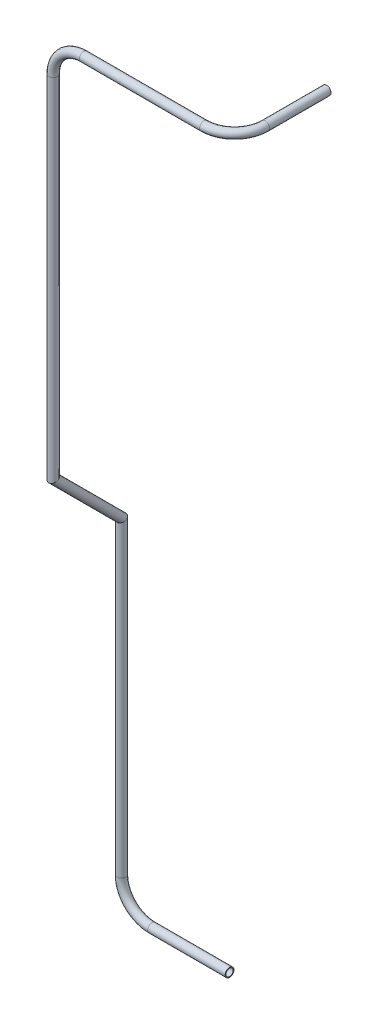
ISO-10303-21;
HEADER;
FILE_DESCRIPTION(('STEP AP214'),'2;1');
FILE_NAME('part.step','',(''),(''),'','','');
FILE_SCHEMA(('AUTOMOTIVE_DESIGN { 1 0 10303 214 1 1 1 1 }'));
ENDSEC;
DATA;
#1=APPLICATION_CONTEXT('core data for automotive mechanical design processes');
#2=APPLICATION_PROTOCOL_DEFINITION('international standard','automotive_design',2000,#1);
#3=PRODUCT_CONTEXT('',#1,'mechanical');
#4=PRODUCT('Part','Part','',(#3));
#5=PRODUCT_RELATED_PRODUCT_CATEGORY('part','',(#4));
#6=PRODUCT_DEFINITION_FORMATION('','',#4);
#7=PRODUCT_DEFINITION_CONTEXT('part definition',#1,'design');
#8=PRODUCT_DEFINITION('design','',#6,#7);
#9=PRODUCT_DEFINITION_SHAPE('','',#8);
#10=(LENGTH_UNIT() NAMED_UNIT(*) SI_UNIT(.MILLI.,.METRE.));
#11=(NAMED_UNIT(*) PLANE_ANGLE_UNIT() SI_UNIT($,.RADIAN.));
#12=(NAMED_UNIT(*) SI_UNIT($,.STERADIAN.) SOLID_ANGLE_UNIT());
#13=UNCERTAINTY_MEASURE_WITH_UNIT(LENGTH_MEASURE(1.E-05),#10,'distance_accuracy_value','');
#14=(GEOMETRIC_REPRESENTATION_CONTEXT(3) GLOBAL_UNCERTAINTY_ASSIGNED_CONTEXT((#13)) GLOBAL_UNIT_ASSIGNED_CONTEXT((#10,
#11,#12)) REPRESENTATION_CONTEXT('',''));
#15=CARTESIAN_POINT('',(0.,0.,0.));
#16=DIRECTION('',(0.,0.,1.));
#17=DIRECTION('',(1.,0.,0.));
#18=AXIS2_PLACEMENT_3D('',#15,#16,#17);
#19=CARTESIAN_POINT('',(-1077.05064960257,1343.43316900332,524.509271735352));
#20=DIRECTION('',(1.,0.,0.));
#21=DIRECTION('',(0.,0.,-1.));
#22=AXIS2_PLACEMENT_3D('',#19,#20,#21);
#23=CYLINDRICAL_SURFACE('',#22,2.61620000000002);
#24=CARTESIAN_POINT('',(-1020.80832925557,1343.43316900332,524.509271735351));
#25=DIRECTION('',(-1.,0.,0.));
#26=DIRECTION('',(0.,0.,1.));
#27=AXIS2_PLACEMENT_3D('',#24,#25,#26);
#28=CIRCLE('',#27,2.61620000000002);
#29=CARTESIAN_POINT('',(-1020.80832925557,1343.43316900332,527.125471735352));
#30=VERTEX_POINT('',#29);
#31=EDGE_CURVE('E54',#30,#30,#28,.T.);
#32=ORIENTED_EDGE('',*,*,#31,.F.);
#33=EDGE_LOOP('',(#32));
#34=FACE_BOUND('',#33,.T.);
#35=CARTESIAN_POINT('',(-1077.05064960257,1343.43316900332,524.509271735352));
#36=DIRECTION('',(1.,0.,0.));
#37=DIRECTION('',(0.,0.,-1.));
#38=AXIS2_PLACEMENT_3D('',#35,#36,#37);
#39=CIRCLE('',#38,2.61620000000002);
#40=CARTESIAN_POINT('',(-1077.05064960257,1340.81696900332,524.509271735352));
#41=VERTEX_POINT('',#40);
#42=EDGE_CURVE('E65',#41,#41,#39,.T.);
#43=ORIENTED_EDGE('',*,*,#42,.F.);
#44=EDGE_LOOP('',(#43));
#45=FACE_BOUND('',#44,.T.);
#46=ADVANCED_FACE('F47',(#34,#45),#23,.F.);
#47=CARTESIAN_POINT('',(-1077.05064960257,1343.43316900332,524.509271735352));
#48=DIRECTION('',(1.,0.,0.));
#49=DIRECTION('',(0.,0.,-1.));
#50=AXIS2_PLACEMENT_3D('',#47,#48,#49);
#51=CYLINDRICAL_SURFACE('',#50,3.175);
#52=CARTESIAN_POINT('',(-1020.80832925557,1343.43316900332,524.509271735351));
#53=DIRECTION('',(-1.,0.,0.));
#54=DIRECTION('',(0.,0.,1.));
#55=AXIS2_PLACEMENT_3D('',#52,#53,#54);
#56=CIRCLE('',#55,3.175);
#57=CARTESIAN_POINT('',(-1020.80832925557,1343.43316900332,527.684271735351));
#58=VERTEX_POINT('',#57);
#59=EDGE_CURVE('E58',#58,#58,#56,.T.);
#60=ORIENTED_EDGE('',*,*,#59,.T.);
#61=EDGE_LOOP('',(#60));
#62=FACE_BOUND('',#61,.T.);
#63=CARTESIAN_POINT('',(-1077.05064960257,1343.43316900332,524.509271735352));
#64=DIRECTION('',(-1.,0.,0.));
#65=DIRECTION('',(0.,0.,1.));
#66=AXIS2_PLACEMENT_3D('',#63,#64,#65);
#67=CIRCLE('',#66,3.175);
#68=CARTESIAN_POINT('',(-1077.05064960257,1340.25816900332,524.509271735352));
#69=VERTEX_POINT('',#68);
#70=EDGE_CURVE('E12',#69,#69,#67,.T.);
#71=ORIENTED_EDGE('',*,*,#70,.F.);
#72=EDGE_LOOP('',(#71));
#73=FACE_BOUND('',#72,.T.);
#74=ADVANCED_FACE('F49',(#62,#73),#51,.T.);
#75=CARTESIAN_POINT('',(-1020.80832925557,1343.43316900332,524.509271735351));
#76=DIRECTION('',(-1.,0.,0.));
#77=DIRECTION('',(0.,0.,1.));
#78=AXIS2_PLACEMENT_3D('',#75,#76,#77);
#79=PLANE('',#78);
#80=ORIENTED_EDGE('',*,*,#31,.T.);
#81=EDGE_LOOP('',(#80));
#82=FACE_BOUND('',#81,.T.);
#83=ORIENTED_EDGE('',*,*,#59,.F.);
#84=EDGE_LOOP('',(#83));
#85=FACE_BOUND('',#84,.T.);
#86=ADVANCED_FACE('F104',(#82,#85),#79,.F.);
#87=CARTESIAN_POINT('',(-1077.05064960257,1365.65816900332,524.509271735352));
#88=DIRECTION('',(0.,0.,1.));
#89=DIRECTION('',(1.,0.,0.));
#90=AXIS2_PLACEMENT_3D('',#87,#88,#89);
#91=TOROIDAL_SURFACE('',#90,22.2249999999997,2.61620000000002);
#92=CARTESIAN_POINT('',(-1099.27564960257,1365.65816900332,524.509271735351));
#93=DIRECTION('',(0.,-1.,0.));
#94=DIRECTION('',(0.,0.,-1.));
#95=AXIS2_PLACEMENT_3D('',#92,#93,#94);
#96=CIRCLE('',#95,2.61620000000002);
#97=CARTESIAN_POINT('',(-1101.89184960257,1365.65816900332,524.509271735351));
#98=VERTEX_POINT('',#97);
#99=EDGE_CURVE('E71',#98,#98,#96,.T.);
#100=CARTESIAN_POINT('',(-1077.05064960257,1365.65816900332,524.509271735352));
#101=DIRECTION('',(0.,0.,1.));
#102=DIRECTION('',(1.,0.,0.));
#103=AXIS2_PLACEMENT_3D('',#100,#101,#102);
#104=CIRCLE('',#103,24.8411999999997);
#105=EDGE_CURVE('',#98,#41,#104,.T.);
#106=ORIENTED_EDGE('',*,*,#99,.F.);
#107=ORIENTED_EDGE('',*,*,#42,.T.);
#108=ORIENTED_EDGE('',*,*,#105,.T.);
#109=ORIENTED_EDGE('',*,*,#105,.F.);
#110=EDGE_LOOP('',(#106,#108,#107,#109));
#111=FACE_BOUND('',#110,.T.);
#112=ADVANCED_FACE('F97',(#111),#91,.F.);
#113=CARTESIAN_POINT('',(-1077.05064960257,1365.65816900332,524.509271735352));
#114=DIRECTION('',(0.,0.,1.));
#115=DIRECTION('',(1.,0.,0.));
#116=AXIS2_PLACEMENT_3D('',#113,#114,#115);
#117=TOROIDAL_SURFACE('',#116,22.2249999999997,3.175);
#118=CARTESIAN_POINT('',(-1099.27564960257,1365.65816900332,524.509271735352));
#119=DIRECTION('',(0.,1.,0.));
#120=DIRECTION('',(0.,0.,1.));
#121=AXIS2_PLACEMENT_3D('',#118,#119,#120);
#122=CIRCLE('',#121,3.175);
#123=CARTESIAN_POINT('',(-1102.45064960257,1365.65816900332,524.509271735352));
#124=VERTEX_POINT('',#123);
#125=EDGE_CURVE('E62',#124,#124,#122,.T.);
#126=CARTESIAN_POINT('',(-1077.05064960257,1365.65816900332,524.509271735352));
#127=DIRECTION('',(0.,0.,1.));
#128=DIRECTION('',(1.,0.,0.));
#129=AXIS2_PLACEMENT_3D('',#126,#127,#128);
#130=CIRCLE('',#129,25.3999999999997);
#131=EDGE_CURVE('',#124,#69,#130,.T.);
#132=ORIENTED_EDGE('',*,*,#125,.F.);
#133=ORIENTED_EDGE('',*,*,#70,.T.);
#134=ORIENTED_EDGE('',*,*,#131,.T.);
#135=ORIENTED_EDGE('',*,*,#131,.F.);
#136=EDGE_LOOP('',(#132,#134,#133,#135));
#137=FACE_BOUND('',#136,.T.);
#138=ADVANCED_FACE('F95',(#137),#117,.T.);
#139=CARTESIAN_POINT('',(-1099.27564960257,1589.9901269649,524.509271735351));
#140=DIRECTION('',(0.,-1.,0.));
#141=DIRECTION('',(0.,0.,-1.));
#142=AXIS2_PLACEMENT_3D('',#139,#140,#141);
#143=CYLINDRICAL_SURFACE('',#142,2.61620000000002);
#144=CARTESIAN_POINT('',(-1099.27564960257,1589.9901269649,524.509271735351));
#145=DIRECTION('',(-0.0038512328374185,0.92387953251129,0.382664052939849));
#146=DIRECTION('',(-0.0092976985479526,-0.382683432365081,0.923832746440064));
#147=AXIS2_PLACEMENT_3D('',#144,#145,#146);
#148=ELLIPSE('',#147,2.83175447440497,2.61620000000002);
#149=CARTESIAN_POINT('',(-1099.30197840203,1588.90646144302,527.125339248685));
#150=VERTEX_POINT('',#149);
#151=EDGE_CURVE('E74',#150,#150,#148,.T.);
#152=ORIENTED_EDGE('',*,*,#151,.T.);
#153=EDGE_LOOP('',(#152));
#154=FACE_BOUND('',#153,.T.);
#155=ORIENTED_EDGE('',*,*,#99,.T.);
#156=EDGE_LOOP('',(#155));
#157=FACE_BOUND('',#156,.T.);
#158=ADVANCED_FACE('F80',(#154,#157),#143,.F.);
#159=CARTESIAN_POINT('',(-1099.27564960257,1589.9901269649,524.509271735351));
#160=DIRECTION('',(0.,-1.,0.));
#161=DIRECTION('',(0.,0.,-1.));
#162=AXIS2_PLACEMENT_3D('',#159,#160,#161);
#163=CYLINDRICAL_SURFACE('',#162,3.175);
#164=CARTESIAN_POINT('',(-1099.27564960257,1589.9901269649,524.509271735351));
#165=DIRECTION('',(-0.0038512328374185,0.92387953251129,0.382664052939849));
#166=DIRECTION('',(-0.0092976985479526,-0.382683432365081,0.923832746440064));
#167=AXIS2_PLACEMENT_3D('',#164,#165,#166);
#168=ELLIPSE('',#167,3.43659523592834,3.175);
#169=CARTESIAN_POINT('',(-1099.3076020291,1588.67499890437,527.684110950562));
#170=VERTEX_POINT('',#169);
#171=EDGE_CURVE('E68',#170,#170,#168,.T.);
#172=ORIENTED_EDGE('',*,*,#171,.F.);
#173=EDGE_LOOP('',(#172));
#174=FACE_BOUND('',#173,.T.);
#175=ORIENTED_EDGE('',*,*,#125,.T.);
#176=EDGE_LOOP('',(#175));
#177=FACE_BOUND('',#176,.T.);
#178=ADVANCED_FACE('F86',(#174,#177),#163,.T.);
#179=CARTESIAN_POINT('',(-1099.27564960257,1589.9901269649,524.509271735351));
#180=DIRECTION('',(-0.0038512328374185,0.92387953251129,0.382664052939849));
#181=DIRECTION('',(0.,-0.382666890806957,0.923886384075518));
#182=AXIS2_PLACEMENT_3D('',#179,#180,#181);
#183=PLANE('',#182);
#184=ORIENTED_EDGE('',*,*,#151,.F.);
#185=EDGE_LOOP('',(#184));
#186=FACE_BOUND('',#185,.T.);
#187=ORIENTED_EDGE('',*,*,#171,.T.);
#188=EDGE_LOOP('',(#187));
#189=FACE_BOUND('',#188,.T.);
#190=ADVANCED_FACE('F83',(#186,#189),#183,.T.);
#191=CLOSED_SHELL('',(#46,#74,#86,#112,#138,#158,#178,#190));
#192=MANIFOLD_SOLID_BREP('B2',#191);
#193=CARTESIAN_POINT('',(-1099.76967828225,1639.08001553007,573.596674345437));
#194=DIRECTION('',(0.00711615038685249,-0.707106781186548,-0.7070709726779));
#195=DIRECTION('',(0.,0.707088876252191,-0.707124685667537));
#196=AXIS2_PLACEMENT_3D('',#193,#194,#195);
#197=CYLINDRICAL_SURFACE('',#196,2.61620000000002);
#198=CARTESIAN_POINT('',(-1099.76967828225,1639.08001553007,573.596674345437));
#199=DIRECTION('',(-0.00385123283741945,0.92387953251129,0.382664052939849));
#200=DIRECTION('',(0.00929769854794952,0.382683432365082,-0.923832746440064));
#201=AXIS2_PLACEMENT_3D('',#198,#199,#200);
#202=ELLIPSE('',#201,2.83175447440499,2.61620000000002);
#203=CARTESIAN_POINT('',(-1099.74334948278,1640.16368105195,570.980606832104));
#204=VERTEX_POINT('',#203);
#205=EDGE_CURVE('E222',#204,#204,#202,.T.);
#206=ORIENTED_EDGE('',*,*,#205,.T.);
#207=EDGE_LOOP('',(#206));
#208=FACE_BOUND('',#207,.T.);
#209=CARTESIAN_POINT('',(-1099.27564960257,1589.9901269649,524.509271735352));
#210=DIRECTION('',(0.0038512328374185,-0.92387953251129,-0.382664052939849));
#211=DIRECTION('',(0.00929769854795181,0.382683432365081,-0.923832746440064));
#212=AXIS2_PLACEMENT_3D('',#209,#210,#211);
#213=ELLIPSE('',#212,2.83175447440499,2.61620000000002);
#214=CARTESIAN_POINT('',(-1099.2493208031,1591.07379248678,521.893204222018));
#215=VERTEX_POINT('',#214);
#216=EDGE_CURVE('E212',#215,#215,#213,.T.);
#217=ORIENTED_EDGE('',*,*,#216,.T.);
#218=EDGE_LOOP('',(#217));
#219=FACE_BOUND('',#218,.T.);
#220=ADVANCED_FACE('F208',(#208,#219),#197,.F.);
#221=CARTESIAN_POINT('',(-1099.76967828225,1639.08001553007,573.596674345437));
#222=DIRECTION('',(0.00711615038685249,-0.707106781186548,-0.7070709726779));
#223=DIRECTION('',(0.,0.707088876252191,-0.707124685667537));
#224=AXIS2_PLACEMENT_3D('',#221,#222,#223);
#225=CYLINDRICAL_SURFACE('',#224,3.175);
#226=CARTESIAN_POINT('',(-1099.76967828225,1639.08001553007,573.596674345437));
#227=DIRECTION('',(-0.00385123283741945,0.92387953251129,0.382664052939849));
#228=DIRECTION('',(0.00929769854794952,0.382683432365082,-0.923832746440064));
#229=AXIS2_PLACEMENT_3D('',#226,#227,#228);
#230=ELLIPSE('',#229,3.43659523592837,3.175);
#231=CARTESIAN_POINT('',(-1099.73772585571,1640.39514359061,570.421835130227));
#232=VERTEX_POINT('',#231);
#233=EDGE_CURVE('E216',#232,#232,#230,.T.);
#234=ORIENTED_EDGE('',*,*,#233,.F.);
#235=EDGE_LOOP('',(#234));
#236=FACE_BOUND('',#235,.T.);
#237=CARTESIAN_POINT('',(-1099.27564960257,1589.9901269649,524.509271735352));
#238=DIRECTION('',(0.0038512328374185,-0.92387953251129,-0.382664052939849));
#239=DIRECTION('',(0.00929769854795181,0.382683432365081,-0.923832746440064));
#240=AXIS2_PLACEMENT_3D('',#237,#238,#239);
#241=ELLIPSE('',#240,3.43659523592837,3.175);
#242=CARTESIAN_POINT('',(-1099.24369717603,1591.30525502543,521.334432520141));
#243=VERTEX_POINT('',#242);
#244=EDGE_CURVE('E46',#243,#243,#241,.T.);
#245=ORIENTED_EDGE('',*,*,#244,.F.);
#246=EDGE_LOOP('',(#245));
#247=FACE_BOUND('',#246,.T.);
#248=ADVANCED_FACE('F235',(#236,#247),#225,.T.);
#249=CARTESIAN_POINT('',(-1099.76967828225,1639.08001553007,573.596674345437));
#250=DIRECTION('',(-0.00385123283741945,0.92387953251129,0.382664052939849));
#251=DIRECTION('',(0.,-0.382666890806957,0.923886384075518));
#252=AXIS2_PLACEMENT_3D('',#249,#250,#251);
#253=PLANE('',#252);
#254=ORIENTED_EDGE('',*,*,#205,.F.);
#255=EDGE_LOOP('',(#254));
#256=FACE_BOUND('',#255,.T.);
#257=ORIENTED_EDGE('',*,*,#233,.T.);
#258=EDGE_LOOP('',(#257));
#259=FACE_BOUND('',#258,.T.);
#260=ADVANCED_FACE('F231',(#256,#259),#253,.T.);
#261=CARTESIAN_POINT('',(-1099.27564960257,1589.9901269649,524.509271735351));
#262=DIRECTION('',(0.0038512328374185,-0.92387953251129,-0.382664052939849));
#263=DIRECTION('',(0.,0.382666890806957,-0.923886384075518));
#264=AXIS2_PLACEMENT_3D('',#261,#262,#263);
#265=PLANE('',#264);
#266=ORIENTED_EDGE('',*,*,#216,.F.);
#267=EDGE_LOOP('',(#266));
#268=FACE_BOUND('',#267,.T.);
#269=ORIENTED_EDGE('',*,*,#244,.T.);
#270=EDGE_LOOP('',(#269));
#271=FACE_BOUND('',#270,.T.);
#272=ADVANCED_FACE('F210',(#268,#271),#265,.T.);
#273=CLOSED_SHELL('',(#220,#248,#260,#272));
#274=MANIFOLD_SOLID_BREP('B7',#273);
#275=CARTESIAN_POINT('',(-1099.76967828225,1893.16375726137,573.596674345437));
#276=DIRECTION('',(0.,-1.,0.));
#277=DIRECTION('',(1.,0.,0.));
#278=AXIS2_PLACEMENT_3D('',#275,#276,#277);
#279=CYLINDRICAL_SURFACE('',#278,2.61620000000002);
#280=CARTESIAN_POINT('',(-1099.76967828225,1893.16375726137,573.596674345437));
#281=DIRECTION('',(0.,-1.,0.));
#282=DIRECTION('',(0.,0.,-1.));
#283=AXIS2_PLACEMENT_3D('',#280,#281,#282);
#284=CIRCLE('',#283,2.61620000000002);
#285=CARTESIAN_POINT('',(-1102.38587828225,1893.16375726137,573.596674345437));
#286=VERTEX_POINT('',#285);
#287=EDGE_CURVE('E306',#286,#286,#284,.T.);
#288=ORIENTED_EDGE('',*,*,#287,.F.);
#289=EDGE_LOOP('',(#288));
#290=FACE_BOUND('',#289,.T.);
#291=CARTESIAN_POINT('',(-1099.76967828225,1639.08001553007,573.596674345437));
#292=DIRECTION('',(0.00385123283741945,-0.92387953251129,-0.38266405293985));
#293=DIRECTION('',(-0.00929769854795032,-0.382683432365082,0.923832746440064));
#294=AXIS2_PLACEMENT_3D('',#291,#292,#293);
#295=ELLIPSE('',#294,2.83175447440497,2.61620000000002);
#296=CARTESIAN_POINT('',(-1099.79600708171,1637.99635000819,576.21274185877));
#297=VERTEX_POINT('',#296);
#298=EDGE_CURVE('E296',#297,#297,#295,.T.);
#299=ORIENTED_EDGE('',*,*,#298,.T.);
#300=EDGE_LOOP('',(#299));
#301=FACE_BOUND('',#300,.T.);
#302=ADVANCED_FACE('F292',(#290,#301),#279,.F.);
#303=CARTESIAN_POINT('',(-1099.76967828225,1893.16375726137,573.596674345437));
#304=DIRECTION('',(0.,-1.,0.));
#305=DIRECTION('',(1.,0.,0.));
#306=AXIS2_PLACEMENT_3D('',#303,#304,#305);
#307=CYLINDRICAL_SURFACE('',#306,3.175);
#308=CARTESIAN_POINT('',(-1099.76967828225,1893.16375726137,573.596674345437));
#309=DIRECTION('',(0.,1.,0.));
#310=DIRECTION('',(0.,0.,1.));
#311=AXIS2_PLACEMENT_3D('',#308,#309,#310);
#312=CIRCLE('',#311,3.175);
#313=CARTESIAN_POINT('',(-1102.94467828225,1893.16375726137,573.596674345437));
#314=VERTEX_POINT('',#313);
#315=EDGE_CURVE('E300',#314,#314,#312,.T.);
#316=ORIENTED_EDGE('',*,*,#315,.F.);
#317=EDGE_LOOP('',(#316));
#318=FACE_BOUND('',#317,.T.);
#319=CARTESIAN_POINT('',(-1099.76967828225,1639.08001553007,573.596674345437));
#320=DIRECTION('',(0.00385123283741945,-0.92387953251129,-0.38266405293985));
#321=DIRECTION('',(-0.00929769854795032,-0.382683432365082,0.923832746440064));
#322=AXIS2_PLACEMENT_3D('',#319,#320,#321);
#323=ELLIPSE('',#322,3.43659523592834,3.175);
#324=CARTESIAN_POINT('',(-1099.80163070878,1637.76488746954,576.771513560647));
#325=VERTEX_POINT('',#324);
#326=EDGE_CURVE('E207',#325,#325,#323,.T.);
#327=ORIENTED_EDGE('',*,*,#326,.F.);
#328=EDGE_LOOP('',(#327));
#329=FACE_BOUND('',#328,.T.);
#330=ADVANCED_FACE('F364',(#318,#329),#307,.T.);
#331=CARTESIAN_POINT('',(-1099.76967828225,1639.08001553007,573.596674345437));
#332=DIRECTION('',(0.00385123283741945,-0.92387953251129,-0.38266405293985));
#333=DIRECTION('',(0.,0.382666890806957,-0.923886384075518));
#334=AXIS2_PLACEMENT_3D('',#331,#332,#333);
#335=PLANE('',#334);
#336=ORIENTED_EDGE('',*,*,#298,.F.);
#337=EDGE_LOOP('',(#336));
#338=FACE_BOUND('',#337,.T.);
#339=ORIENTED_EDGE('',*,*,#326,.T.);
#340=EDGE_LOOP('',(#339));
#341=FACE_BOUND('',#340,.T.);
#342=ADVANCED_FACE('F294',(#338,#341),#335,.T.);
#343=CARTESIAN_POINT('',(-1077.54467828225,1893.16375726137,573.596674345437));
#344=DIRECTION('',(0.,0.,1.));
#345=DIRECTION('',(1.,0.,0.));
#346=AXIS2_PLACEMENT_3D('',#343,#344,#345);
#347=TOROIDAL_SURFACE('',#346,22.2250000000004,2.61620000000002);
#348=CARTESIAN_POINT('',(-1077.54467828225,1915.38875726137,573.596674345437));
#349=DIRECTION('',(-1.,0.,0.));
#350=DIRECTION('',(0.,0.,1.));
#351=AXIS2_PLACEMENT_3D('',#348,#349,#350);
#352=CIRCLE('',#351,2.61620000000002);
#353=CARTESIAN_POINT('',(-1077.54467828225,1918.00495726137,573.596674345437));
#354=VERTEX_POINT('',#353);
#355=EDGE_CURVE('E313',#354,#354,#352,.T.);
#356=CARTESIAN_POINT('',(-1077.54467828225,1893.16375726137,573.596674345437));
#357=DIRECTION('',(0.,0.,1.));
#358=DIRECTION('',(1.,0.,0.));
#359=AXIS2_PLACEMENT_3D('',#356,#357,#358);
#360=CIRCLE('',#359,24.8412000000004);
#361=EDGE_CURVE('',#354,#286,#360,.T.);
#362=ORIENTED_EDGE('',*,*,#355,.F.);
#363=ORIENTED_EDGE('',*,*,#287,.T.);
#364=ORIENTED_EDGE('',*,*,#361,.T.);
#365=ORIENTED_EDGE('',*,*,#361,.F.);
#366=EDGE_LOOP('',(#362,#364,#363,#365));
#367=FACE_BOUND('',#366,.T.);
#368=ADVANCED_FACE('F360',(#367),#347,.F.);
#369=CARTESIAN_POINT('',(-1077.54467828225,1893.16375726137,573.596674345437));
#370=DIRECTION('',(0.,0.,1.));
#371=DIRECTION('',(1.,0.,0.));
#372=AXIS2_PLACEMENT_3D('',#369,#370,#371);
#373=TOROIDAL_SURFACE('',#372,22.2250000000004,3.175);
#374=CARTESIAN_POINT('',(-1077.54467828225,1915.38875726137,573.596674345437));
#375=DIRECTION('',(1.,0.,0.));
#376=DIRECTION('',(0.,0.,-1.));
#377=AXIS2_PLACEMENT_3D('',#374,#375,#376);
#378=CIRCLE('',#377,3.175);
#379=CARTESIAN_POINT('',(-1077.54467828225,1918.56375726137,573.596674345437));
#380=VERTEX_POINT('',#379);
#381=EDGE_CURVE('E309',#380,#380,#378,.T.);
#382=CARTESIAN_POINT('',(-1077.54467828225,1893.16375726137,573.596674345437));
#383=DIRECTION('',(0.,0.,1.));
#384=DIRECTION('',(1.,0.,0.));
#385=AXIS2_PLACEMENT_3D('',#382,#383,#384);
#386=CIRCLE('',#385,25.4000000000004);
#387=EDGE_CURVE('',#380,#314,#386,.T.);
#388=ORIENTED_EDGE('',*,*,#381,.F.);
#389=ORIENTED_EDGE('',*,*,#315,.T.);
#390=ORIENTED_EDGE('',*,*,#387,.T.);
#391=ORIENTED_EDGE('',*,*,#387,.F.);
#392=EDGE_LOOP('',(#388,#390,#389,#391));
#393=FACE_BOUND('',#392,.T.);
#394=ADVANCED_FACE('F357',(#393),#373,.T.);
#395=CARTESIAN_POINT('',(-990.287426172778,1915.38875726137,573.596674345437));
#396=DIRECTION('',(-1.,0.,0.));
#397=DIRECTION('',(0.,0.,1.));
#398=AXIS2_PLACEMENT_3D('',#395,#396,#397);
#399=CYLINDRICAL_SURFACE('',#398,2.61620000000002);
#400=CARTESIAN_POINT('',(-990.287426172778,1915.38875726137,573.596674345437));
#401=DIRECTION('',(-1.,0.,0.));
#402=DIRECTION('',(0.,0.,1.));
#403=AXIS2_PLACEMENT_3D('',#400,#401,#402);
#404=CIRCLE('',#403,2.61620000000002);
#405=CARTESIAN_POINT('',(-990.287426172778,1915.38875726137,576.212874345437));
#406=VERTEX_POINT('',#405);
#407=EDGE_CURVE('E319',#406,#406,#404,.T.);
#408=ORIENTED_EDGE('',*,*,#407,.F.);
#409=EDGE_LOOP('',(#408));
#410=FACE_BOUND('',#409,.T.);
#411=ORIENTED_EDGE('',*,*,#355,.T.);
#412=EDGE_LOOP('',(#411));
#413=FACE_BOUND('',#412,.T.);
#414=ADVANCED_FACE('F353',(#410,#413),#399,.F.);
#415=CARTESIAN_POINT('',(-990.287426172778,1915.38875726137,573.596674345437));
#416=DIRECTION('',(-1.,0.,0.));
#417=DIRECTION('',(0.,0.,1.));
#418=AXIS2_PLACEMENT_3D('',#415,#416,#417);
#419=CYLINDRICAL_SURFACE('',#418,3.175);
#420=CARTESIAN_POINT('',(-990.287426172778,1915.38875726137,573.596674345437));
#421=DIRECTION('',(1.,0.,0.));
#422=DIRECTION('',(0.,0.,-1.));
#423=AXIS2_PLACEMENT_3D('',#420,#421,#422);
#424=CIRCLE('',#423,3.175);
#425=CARTESIAN_POINT('',(-990.287426172778,1915.38875726137,576.771674345437));
#426=VERTEX_POINT('',#425);
#427=EDGE_CURVE('E310',#426,#426,#424,.T.);
#428=ORIENTED_EDGE('',*,*,#427,.F.);
#429=EDGE_LOOP('',(#428));
#430=FACE_BOUND('',#429,.T.);
#431=ORIENTED_EDGE('',*,*,#381,.T.);
#432=EDGE_LOOP('',(#431));
#433=FACE_BOUND('',#432,.T.);
#434=ADVANCED_FACE('F350',(#430,#433),#419,.T.);
#435=CARTESIAN_POINT('',(-990.287426172778,1915.38875726137,551.371674345437));
#436=DIRECTION('',(0.,-1.,0.));
#437=DIRECTION('',(0.,0.,-1.));
#438=AXIS2_PLACEMENT_3D('',#435,#436,#437);
#439=TOROIDAL_SURFACE('',#438,22.2250000000001,2.61620000000002);
#440=CARTESIAN_POINT('',(-968.062426172778,1915.38875726137,551.371674345437));
#441=DIRECTION('',(0.,0.,1.));
#442=DIRECTION('',(1.,0.,0.));
#443=AXIS2_PLACEMENT_3D('',#440,#441,#442);
#444=CIRCLE('',#443,2.61620000000002);
#445=CARTESIAN_POINT('',(-965.446226172778,1915.38875726137,551.371674345437));
#446=VERTEX_POINT('',#445);
#447=EDGE_CURVE('E325',#446,#446,#444,.T.);
#448=CARTESIAN_POINT('',(-990.287426172778,1915.38875726137,551.371674345437));
#449=DIRECTION('',(0.,-1.,0.));
#450=DIRECTION('',(0.,0.,-1.));
#451=AXIS2_PLACEMENT_3D('',#448,#449,#450);
#452=CIRCLE('',#451,24.8412000000001);
#453=EDGE_CURVE('',#446,#406,#452,.T.);
#454=ORIENTED_EDGE('',*,*,#447,.F.);
#455=ORIENTED_EDGE('',*,*,#407,.T.);
#456=ORIENTED_EDGE('',*,*,#453,.T.);
#457=ORIENTED_EDGE('',*,*,#453,.F.);
#458=EDGE_LOOP('',(#454,#456,#455,#457));
#459=FACE_BOUND('',#458,.T.);
#460=ADVANCED_FACE('F346',(#459),#439,.F.);
#461=CARTESIAN_POINT('',(-990.287426172778,1915.38875726137,551.371674345437));
#462=DIRECTION('',(0.,-1.,0.));
#463=DIRECTION('',(0.,0.,-1.));
#464=AXIS2_PLACEMENT_3D('',#461,#462,#463);
#465=TOROIDAL_SURFACE('',#464,22.2250000000001,3.175);
#466=CARTESIAN_POINT('',(-968.062426172778,1915.38875726137,551.371674345437));
#467=DIRECTION('',(0.,0.,-1.));
#468=DIRECTION('',(-1.,0.,0.));
#469=AXIS2_PLACEMENT_3D('',#466,#467,#468);
#470=CIRCLE('',#469,3.175);
#471=CARTESIAN_POINT('',(-964.887426172778,1915.38875726137,551.371674345437));
#472=VERTEX_POINT('',#471);
#473=EDGE_CURVE('E316',#472,#472,#470,.T.);
#474=CARTESIAN_POINT('',(-990.287426172778,1915.38875726137,551.371674345437));
#475=DIRECTION('',(0.,-1.,0.));
#476=DIRECTION('',(0.,0.,-1.));
#477=AXIS2_PLACEMENT_3D('',#474,#475,#476);
#478=CIRCLE('',#477,25.4000000000001);
#479=EDGE_CURVE('',#472,#426,#478,.T.);
#480=ORIENTED_EDGE('',*,*,#473,.F.);
#481=ORIENTED_EDGE('',*,*,#427,.T.);
#482=ORIENTED_EDGE('',*,*,#479,.T.);
#483=ORIENTED_EDGE('',*,*,#479,.F.);
#484=EDGE_LOOP('',(#480,#482,#481,#483));
#485=FACE_BOUND('',#484,.T.);
#486=ADVANCED_FACE('F343',(#485),#465,.T.);
#487=CARTESIAN_POINT('',(-968.062426172778,1915.38875726137,506.778243179392));
#488=DIRECTION('',(0.,0.,1.));
#489=DIRECTION('',(1.,0.,0.));
#490=AXIS2_PLACEMENT_3D('',#487,#488,#489);
#491=CYLINDRICAL_SURFACE('',#490,2.61620000000002);
#492=CARTESIAN_POINT('',(-968.062426172778,1915.38875726137,506.778243179392));
#493=DIRECTION('',(0.,0.,-1.));
#494=DIRECTION('',(1.,0.,0.));
#495=AXIS2_PLACEMENT_3D('',#492,#493,#494);
#496=CIRCLE('',#495,2.61620000000002);
#497=CARTESIAN_POINT('',(-965.446226172778,1915.38875726137,506.778243179392));
#498=VERTEX_POINT('',#497);
#499=EDGE_CURVE('E328',#498,#498,#496,.T.);
#500=ORIENTED_EDGE('',*,*,#499,.T.);
#501=EDGE_LOOP('',(#500));
#502=FACE_BOUND('',#501,.T.);
#503=ORIENTED_EDGE('',*,*,#447,.T.);
#504=EDGE_LOOP('',(#503));
#505=FACE_BOUND('',#504,.T.);
#506=ADVANCED_FACE('F339',(#502,#505),#491,.F.);
#507=CARTESIAN_POINT('',(-968.062426172778,1915.38875726137,506.778243179392));
#508=DIRECTION('',(0.,0.,1.));
#509=DIRECTION('',(1.,0.,0.));
#510=AXIS2_PLACEMENT_3D('',#507,#508,#509);
#511=CYLINDRICAL_SURFACE('',#510,3.175);
#512=CARTESIAN_POINT('',(-968.062426172778,1915.38875726137,506.778243179392));
#513=DIRECTION('',(0.,0.,-1.));
#514=DIRECTION('',(1.,0.,0.));
#515=AXIS2_PLACEMENT_3D('',#512,#513,#514);
#516=CIRCLE('',#515,3.175);
#517=CARTESIAN_POINT('',(-964.887426172778,1915.38875726137,506.778243179392));
#518=VERTEX_POINT('',#517);
#519=EDGE_CURVE('E322',#518,#518,#516,.T.);
#520=ORIENTED_EDGE('',*,*,#519,.F.);
#521=EDGE_LOOP('',(#520));
#522=FACE_BOUND('',#521,.T.);
#523=ORIENTED_EDGE('',*,*,#473,.T.);
#524=EDGE_LOOP('',(#523));
#525=FACE_BOUND('',#524,.T.);
#526=ADVANCED_FACE('F336',(#522,#525),#511,.T.);
#527=CARTESIAN_POINT('',(-968.062426172778,1915.38875726137,506.778243179392));
#528=DIRECTION('',(0.,0.,-1.));
#529=DIRECTION('',(1.,0.,0.));
#530=AXIS2_PLACEMENT_3D('',#527,#528,#529);
#531=PLANE('',#530);
#532=ORIENTED_EDGE('',*,*,#499,.F.);
#533=EDGE_LOOP('',(#532));
#534=FACE_BOUND('',#533,.T.);
#535=ORIENTED_EDGE('',*,*,#519,.T.);
#536=EDGE_LOOP('',(#535));
#537=FACE_BOUND('',#536,.T.);
#538=ADVANCED_FACE('F334',(#534,#537),#531,.T.);
#539=CLOSED_SHELL('',(#302,#330,#342,#368,#394,#414,#434,#460,#486,#506,#526,#538));
#540=MANIFOLD_SOLID_BREP('B41',#539);
#541=ADVANCED_BREP_SHAPE_REPRESENTATION('',(#18,#192,#274,#540),#14);
#542=SHAPE_DEFINITION_REPRESENTATION(#9,#541);
ENDSEC;
END-ISO-10303-21;
